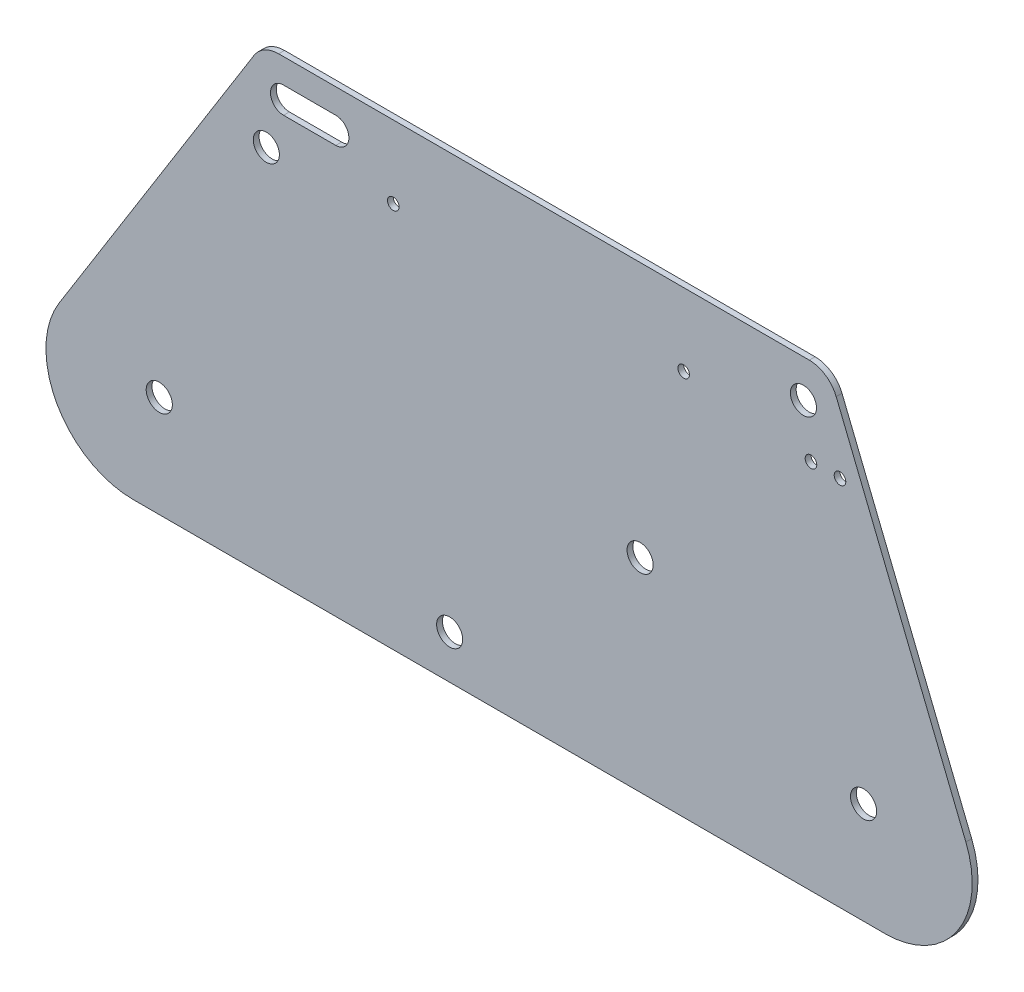
ISO-10303-21;
HEADER;
FILE_DESCRIPTION(('STEP AP214'),'2;1');
FILE_NAME('part.step','',(''),(''),'','','');
FILE_SCHEMA(('AUTOMOTIVE_DESIGN { 1 0 10303 214 1 1 1 1 }'));
ENDSEC;
DATA;
#1=APPLICATION_CONTEXT('core data for automotive mechanical design processes');
#2=APPLICATION_PROTOCOL_DEFINITION('international standard','automotive_design',2000,#1);
#3=PRODUCT_CONTEXT('',#1,'mechanical');
#4=PRODUCT('Part','Part','',(#3));
#5=PRODUCT_RELATED_PRODUCT_CATEGORY('part','',(#4));
#6=PRODUCT_DEFINITION_FORMATION('','',#4);
#7=PRODUCT_DEFINITION_CONTEXT('part definition',#1,'design');
#8=PRODUCT_DEFINITION('design','',#6,#7);
#9=PRODUCT_DEFINITION_SHAPE('','',#8);
#10=(LENGTH_UNIT() NAMED_UNIT(*) SI_UNIT(.MILLI.,.METRE.));
#11=(NAMED_UNIT(*) PLANE_ANGLE_UNIT() SI_UNIT($,.RADIAN.));
#12=(NAMED_UNIT(*) SI_UNIT($,.STERADIAN.) SOLID_ANGLE_UNIT());
#13=UNCERTAINTY_MEASURE_WITH_UNIT(LENGTH_MEASURE(1.E-05),#10,'distance_accuracy_value','');
#14=(GEOMETRIC_REPRESENTATION_CONTEXT(3) GLOBAL_UNCERTAINTY_ASSIGNED_CONTEXT((#13)) GLOBAL_UNIT_ASSIGNED_CONTEXT((#10,
#11,#12)) REPRESENTATION_CONTEXT('',''));
#15=CARTESIAN_POINT('',(0.,0.,0.));
#16=DIRECTION('',(0.,0.,1.));
#17=DIRECTION('',(1.,0.,0.));
#18=AXIS2_PLACEMENT_3D('',#15,#16,#17);
#19=CARTESIAN_POINT('',(0.,0.,2.));
#20=DIRECTION('',(0.,0.,1.));
#21=DIRECTION('',(1.,0.,0.));
#22=AXIS2_PLACEMENT_3D('',#19,#20,#21);
#23=PLANE('',#22);
#24=CARTESIAN_POINT('',(287.565501283629,128.,2.));
#25=DIRECTION('',(0.,0.,1.));
#26=DIRECTION('',(1.,0.,0.));
#27=AXIS2_PLACEMENT_3D('',#24,#25,#26);
#28=CIRCLE('',#27,2.);
#29=CARTESIAN_POINT('',(289.565501283629,128.,2.));
#30=VERTEX_POINT('',#29);
#31=EDGE_CURVE('E558',#30,#30,#28,.T.);
#32=ORIENTED_EDGE('',*,*,#31,.F.);
#33=EDGE_LOOP('',(#32));
#34=FACE_BOUND('',#33,.T.);
#35=CARTESIAN_POINT('',(243.729357601673,133.,2.));
#36=DIRECTION('',(0.,0.,1.));
#37=DIRECTION('',(1.,0.,0.));
#38=AXIS2_PLACEMENT_3D('',#35,#36,#37);
#39=CIRCLE('',#38,2.);
#40=CARTESIAN_POINT('',(245.729357601673,133.,2.));
#41=VERTEX_POINT('',#40);
#42=EDGE_CURVE('E570',#41,#41,#39,.T.);
#43=ORIENTED_EDGE('',*,*,#42,.F.);
#44=EDGE_LOOP('',(#43));
#45=FACE_BOUND('',#44,.T.);
#46=CARTESIAN_POINT('',(228.729357601673,70.,2.));
#47=DIRECTION('',(0.,0.,1.));
#48=DIRECTION('',(1.,0.,0.));
#49=AXIS2_PLACEMENT_3D('',#46,#47,#48);
#50=CIRCLE('',#49,4.50000000000002);
#51=CARTESIAN_POINT('',(233.229357601673,70.,2.));
#52=VERTEX_POINT('',#51);
#53=EDGE_CURVE('E582',#52,#52,#50,.T.);
#54=ORIENTED_EDGE('',*,*,#53,.F.);
#55=EDGE_LOOP('',(#54));
#56=FACE_BOUND('',#55,.T.);
#57=CARTESIAN_POINT('',(63.1416714344996,35.,2.));
#58=DIRECTION('',(0.,0.,1.));
#59=DIRECTION('',(1.,0.,0.));
#60=AXIS2_PLACEMENT_3D('',#57,#58,#59);
#61=CIRCLE('',#60,4.50000000000001);
#62=CARTESIAN_POINT('',(67.6416714344996,35.,2.));
#63=VERTEX_POINT('',#62);
#64=EDGE_CURVE('E594',#63,#63,#61,.T.);
#65=ORIENTED_EDGE('',*,*,#64,.F.);
#66=EDGE_LOOP('',(#65));
#67=FACE_BOUND('',#66,.T.);
#68=CARTESIAN_POINT('',(284.960746882722,145.,2.));
#69=DIRECTION('',(0.,0.,1.));
#70=DIRECTION('',(1.,0.,0.));
#71=AXIS2_PLACEMENT_3D('',#68,#69,#70);
#72=CIRCLE('',#71,4.50000000000002);
#73=CARTESIAN_POINT('',(289.460746882722,145.,2.));
#74=VERTEX_POINT('',#73);
#75=EDGE_CURVE('E170',#74,#74,#72,.T.);
#76=ORIENTED_EDGE('',*,*,#75,.F.);
#77=EDGE_LOOP('',(#76));
#78=FACE_BOUND('',#77,.T.);
#79=DIRECTION('',(-0.374606593415916,0.927183854566786,0.));
#80=VECTOR('',#79,1.);
#81=CARTESIAN_POINT('',(357.565501283629,0.,2.));
#82=LINE('',#81,#80);
#83=CARTESIAN_POINT('',(340.90418786525,41.2381978024775,2.));
#84=VERTEX_POINT('',#83);
#85=CARTESIAN_POINT('',(296.256110978917,151.746065934159,2.));
#86=VERTEX_POINT('',#85);
#87=EDGE_CURVE('E191',#84,#86,#82,.T.);
#88=ORIENTED_EDGE('',*,*,#87,.T.);
#89=CARTESIAN_POINT('',(286.984272433249,148.,2.));
#90=DIRECTION('',(0.,0.,1.));
#91=DIRECTION('',(1.,0.,0.));
#92=AXIS2_PLACEMENT_3D('',#89,#90,#91);
#93=CIRCLE('',#92,10.);
#94=CARTESIAN_POINT('',(286.984272433249,158.,2.));
#95=VERTEX_POINT('',#94);
#96=EDGE_CURVE('E46',#86,#95,#93,.T.);
#97=ORIENTED_EDGE('',*,*,#96,.T.);
#98=DIRECTION('',(-1.,0.,0.));
#99=VECTOR('',#98,1.);
#100=CARTESIAN_POINT('',(98.7293576016731,158.,2.));
#101=LINE('',#100,#99);
#102=CARTESIAN_POINT('',(104.272448116201,158.,2.));
#103=VERTEX_POINT('',#102);
#104=EDGE_CURVE('E195',#95,#103,#101,.T.);
#105=ORIENTED_EDGE('',*,*,#104,.T.);
#106=CARTESIAN_POINT('',(104.272448116201,148.,2.));
#107=DIRECTION('',(0.,0.,1.));
#108=DIRECTION('',(1.,0.,0.));
#109=AXIS2_PLACEMENT_3D('',#106,#107,#108);
#110=CIRCLE('',#109,10.);
#111=CARTESIAN_POINT('',(95.7919671546366,153.299192642332,2.));
#112=VERTEX_POINT('',#111);
#113=EDGE_CURVE('E53',#103,#112,#110,.T.);
#114=ORIENTED_EDGE('',*,*,#113,.T.);
#115=DIRECTION('',(-0.529919264233203,-0.848048096156428,0.));
#116=VECTOR('',#115,1.);
#117=CARTESIAN_POINT('',(0.,0.,2.));
#118=LINE('',#117,#116);
#119=CARTESIAN_POINT('',(28.6799897734497,45.8975779269961,2.));
#120=VERTEX_POINT('',#119);
#121=EDGE_CURVE('E198',#112,#120,#118,.T.);
#122=ORIENTED_EDGE('',*,*,#121,.T.);
#123=CARTESIAN_POINT('',(54.1214326581425,30.,2.));
#124=DIRECTION('',(0.,0.,1.));
#125=DIRECTION('',(1.,0.,0.));
#126=AXIS2_PLACEMENT_3D('',#123,#124,#125);
#127=CIRCLE('',#126,30.);
#128=CARTESIAN_POINT('',(54.1214326581425,0.,2.));
#129=VERTEX_POINT('',#128);
#130=EDGE_CURVE('E231',#120,#129,#127,.T.);
#131=ORIENTED_EDGE('',*,*,#130,.T.);
#132=DIRECTION('',(1.,0.,0.));
#133=VECTOR('',#132,1.);
#134=CARTESIAN_POINT('',(0.,0.,2.));
#135=LINE('',#134,#133);
#136=CARTESIAN_POINT('',(313.088672228246,0.,2.));
#137=VERTEX_POINT('',#136);
#138=EDGE_CURVE('E187',#129,#137,#135,.T.);
#139=ORIENTED_EDGE('',*,*,#138,.T.);
#140=CARTESIAN_POINT('',(313.088672228246,30.,2.));
#141=DIRECTION('',(0.,0.,1.));
#142=DIRECTION('',(1.,0.,0.));
#143=AXIS2_PLACEMENT_3D('',#140,#141,#142);
#144=CIRCLE('',#143,30.);
#145=EDGE_CURVE('E234',#137,#84,#144,.T.);
#146=ORIENTED_EDGE('',*,*,#145,.T.);
#147=EDGE_LOOP('',(#88,#97,#105,#114,#122,#131,#139,#146));
#148=FACE_BOUND('',#147,.T.);
#149=DIRECTION('',(1.,0.,0.));
#150=VECTOR('',#149,1.);
#151=CARTESIAN_POINT('',(105.935375270559,140.5,2.));
#152=LINE('',#151,#150);
#153=CARTESIAN_POINT('',(105.935375270559,140.5,2.));
#154=VERTEX_POINT('',#153);
#155=CARTESIAN_POINT('',(123.935375270559,140.5,2.));
#156=VERTEX_POINT('',#155);
#157=EDGE_CURVE('E142',#154,#156,#152,.T.);
#158=ORIENTED_EDGE('',*,*,#157,.F.);
#159=CARTESIAN_POINT('',(105.935375270559,145.,2.));
#160=DIRECTION('',(0.,0.,1.));
#161=DIRECTION('',(1.,0.,0.));
#162=AXIS2_PLACEMENT_3D('',#159,#160,#161);
#163=CIRCLE('',#162,4.49999999999998);
#164=CARTESIAN_POINT('',(105.935375270559,149.5,2.));
#165=VERTEX_POINT('',#164);
#166=EDGE_CURVE('E131',#165,#154,#163,.T.);
#167=ORIENTED_EDGE('',*,*,#166,.F.);
#168=DIRECTION('',(-1.,0.,0.));
#169=VECTOR('',#168,1.);
#170=CARTESIAN_POINT('',(105.935375270559,149.5,2.));
#171=LINE('',#170,#169);
#172=CARTESIAN_POINT('',(123.935375270559,149.5,2.));
#173=VERTEX_POINT('',#172);
#174=EDGE_CURVE('E161',#173,#165,#171,.T.);
#175=ORIENTED_EDGE('',*,*,#174,.F.);
#176=CARTESIAN_POINT('',(123.935375270559,145.,2.));
#177=DIRECTION('',(0.,0.,1.));
#178=DIRECTION('',(1.,0.,0.));
#179=AXIS2_PLACEMENT_3D('',#176,#177,#178);
#180=CIRCLE('',#179,4.49999999999998);
#181=EDGE_CURVE('E157',#156,#173,#180,.T.);
#182=ORIENTED_EDGE('',*,*,#181,.F.);
#183=EDGE_LOOP('',(#158,#167,#175,#182));
#184=FACE_BOUND('',#183,.T.);
#185=CARTESIAN_POINT('',(305.675867385683,35.,2.));
#186=DIRECTION('',(0.,0.,1.));
#187=DIRECTION('',(1.,0.,0.));
#188=AXIS2_PLACEMENT_3D('',#185,#186,#187);
#189=CIRCLE('',#188,4.50000000000002);
#190=CARTESIAN_POINT('',(310.175867385683,35.,2.));
#191=VERTEX_POINT('',#190);
#192=EDGE_CURVE('E600',#191,#191,#189,.T.);
#193=ORIENTED_EDGE('',*,*,#192,.F.);
#194=EDGE_LOOP('',(#193));
#195=FACE_BOUND('',#194,.T.);
#196=CARTESIAN_POINT('',(163.1416714345,15.,2.));
#197=DIRECTION('',(0.,0.,1.));
#198=DIRECTION('',(1.,0.,0.));
#199=AXIS2_PLACEMENT_3D('',#196,#197,#198);
#200=CIRCLE('',#199,4.49999999999999);
#201=CARTESIAN_POINT('',(167.6416714345,15.,2.));
#202=VERTEX_POINT('',#201);
#203=EDGE_CURVE('E588',#202,#202,#200,.T.);
#204=ORIENTED_EDGE('',*,*,#203,.F.);
#205=EDGE_LOOP('',(#204));
#206=FACE_BOUND('',#205,.T.);
#207=CARTESIAN_POINT('',(100.,128.,2.));
#208=DIRECTION('',(0.,0.,1.));
#209=DIRECTION('',(1.,0.,0.));
#210=AXIS2_PLACEMENT_3D('',#207,#208,#209);
#211=CIRCLE('',#210,4.49999999999999);
#212=CARTESIAN_POINT('',(104.5,128.,2.));
#213=VERTEX_POINT('',#212);
#214=EDGE_CURVE('E576',#213,#213,#211,.T.);
#215=ORIENTED_EDGE('',*,*,#214,.F.);
#216=EDGE_LOOP('',(#215));
#217=FACE_BOUND('',#216,.T.);
#218=CARTESIAN_POINT('',(143.729357601673,133.,2.));
#219=DIRECTION('',(0.,0.,1.));
#220=DIRECTION('',(1.,0.,0.));
#221=AXIS2_PLACEMENT_3D('',#218,#219,#220);
#222=CIRCLE('',#221,2.);
#223=CARTESIAN_POINT('',(145.729357601673,133.,2.));
#224=VERTEX_POINT('',#223);
#225=EDGE_CURVE('E564',#224,#224,#222,.T.);
#226=ORIENTED_EDGE('',*,*,#225,.F.);
#227=EDGE_LOOP('',(#226));
#228=FACE_BOUND('',#227,.T.);
#229=CARTESIAN_POINT('',(297.565501283629,128.,2.));
#230=DIRECTION('',(0.,0.,1.));
#231=DIRECTION('',(1.,0.,0.));
#232=AXIS2_PLACEMENT_3D('',#229,#230,#231);
#233=CIRCLE('',#232,2.);
#234=CARTESIAN_POINT('',(299.565501283629,128.,2.));
#235=VERTEX_POINT('',#234);
#236=EDGE_CURVE('E552',#235,#235,#233,.T.);
#237=ORIENTED_EDGE('',*,*,#236,.F.);
#238=EDGE_LOOP('',(#237));
#239=FACE_BOUND('',#238,.T.);
#240=ADVANCED_FACE('F37',(#34,#45,#56,#67,#78,#148,#184,#195,#206,#217,#228,#239),#23,.T.);
#241=CARTESIAN_POINT('',(0.,0.,0.));
#242=DIRECTION('',(0.,0.,1.));
#243=DIRECTION('',(1.,0.,0.));
#244=AXIS2_PLACEMENT_3D('',#241,#242,#243);
#245=PLANE('',#244);
#246=DIRECTION('',(-1.,0.,0.));
#247=VECTOR('',#246,1.);
#248=CARTESIAN_POINT('',(98.7293576016731,158.,0.));
#249=LINE('',#248,#247);
#250=CARTESIAN_POINT('',(286.984272433249,158.,0.));
#251=VERTEX_POINT('',#250);
#252=CARTESIAN_POINT('',(104.272448116201,158.,0.));
#253=VERTEX_POINT('',#252);
#254=EDGE_CURVE('E208',#251,#253,#249,.T.);
#255=ORIENTED_EDGE('',*,*,#254,.F.);
#256=CARTESIAN_POINT('',(286.984272433249,148.,0.));
#257=DIRECTION('',(0.,0.,1.));
#258=DIRECTION('',(1.,0.,0.));
#259=AXIS2_PLACEMENT_3D('',#256,#257,#258);
#260=CIRCLE('',#259,10.);
#261=CARTESIAN_POINT('',(296.256110978917,151.746065934159,0.));
#262=VERTEX_POINT('',#261);
#263=EDGE_CURVE('E251',#251,#262,#260,.F.);
#264=ORIENTED_EDGE('',*,*,#263,.T.);
#265=DIRECTION('',(-0.374606593415916,0.927183854566786,0.));
#266=VECTOR('',#265,1.);
#267=CARTESIAN_POINT('',(357.565501283629,0.,0.));
#268=LINE('',#267,#266);
#269=CARTESIAN_POINT('',(340.90418786525,41.2381978024775,0.));
#270=VERTEX_POINT('',#269);
#271=EDGE_CURVE('E205',#270,#262,#268,.T.);
#272=ORIENTED_EDGE('',*,*,#271,.F.);
#273=CARTESIAN_POINT('',(313.088672228246,30.,0.));
#274=DIRECTION('',(0.,0.,1.));
#275=DIRECTION('',(1.,0.,0.));
#276=AXIS2_PLACEMENT_3D('',#273,#274,#275);
#277=CIRCLE('',#276,30.);
#278=CARTESIAN_POINT('',(313.088672228246,0.,0.));
#279=VERTEX_POINT('',#278);
#280=EDGE_CURVE('E221',#270,#279,#277,.F.);
#281=ORIENTED_EDGE('',*,*,#280,.T.);
#282=DIRECTION('',(1.,0.,0.));
#283=VECTOR('',#282,1.);
#284=CARTESIAN_POINT('',(0.,0.,0.));
#285=LINE('',#284,#283);
#286=CARTESIAN_POINT('',(54.1214326581425,0.,0.));
#287=VERTEX_POINT('',#286);
#288=EDGE_CURVE('E151',#287,#279,#285,.T.);
#289=ORIENTED_EDGE('',*,*,#288,.F.);
#290=CARTESIAN_POINT('',(54.1214326581425,30.,0.));
#291=DIRECTION('',(0.,0.,1.));
#292=DIRECTION('',(1.,0.,0.));
#293=AXIS2_PLACEMENT_3D('',#290,#291,#292);
#294=CIRCLE('',#293,30.);
#295=CARTESIAN_POINT('',(28.6799897734497,45.8975779269961,0.));
#296=VERTEX_POINT('',#295);
#297=EDGE_CURVE('E217',#287,#296,#294,.F.);
#298=ORIENTED_EDGE('',*,*,#297,.T.);
#299=DIRECTION('',(-0.529919264233203,-0.848048096156428,0.));
#300=VECTOR('',#299,1.);
#301=CARTESIAN_POINT('',(0.,0.,0.));
#302=LINE('',#301,#300);
#303=CARTESIAN_POINT('',(95.7919671546366,153.299192642332,0.));
#304=VERTEX_POINT('',#303);
#305=EDGE_CURVE('E192',#304,#296,#302,.T.);
#306=ORIENTED_EDGE('',*,*,#305,.F.);
#307=CARTESIAN_POINT('',(104.272448116201,148.,0.));
#308=DIRECTION('',(0.,0.,1.));
#309=DIRECTION('',(1.,0.,0.));
#310=AXIS2_PLACEMENT_3D('',#307,#308,#309);
#311=CIRCLE('',#310,10.);
#312=EDGE_CURVE('E248',#304,#253,#311,.F.);
#313=ORIENTED_EDGE('',*,*,#312,.T.);
#314=EDGE_LOOP('',(#255,#264,#272,#281,#289,#298,#306,#313));
#315=FACE_BOUND('',#314,.T.);
#316=CARTESIAN_POINT('',(105.935375270559,145.,0.));
#317=DIRECTION('',(0.,0.,1.));
#318=DIRECTION('',(1.,0.,0.));
#319=AXIS2_PLACEMENT_3D('',#316,#317,#318);
#320=CIRCLE('',#319,4.49999999999998);
#321=CARTESIAN_POINT('',(105.935375270559,149.5,0.));
#322=VERTEX_POINT('',#321);
#323=CARTESIAN_POINT('',(105.935375270559,140.5,0.));
#324=VERTEX_POINT('',#323);
#325=EDGE_CURVE('E167',#322,#324,#320,.T.);
#326=ORIENTED_EDGE('',*,*,#325,.T.);
#327=DIRECTION('',(1.,0.,0.));
#328=VECTOR('',#327,1.);
#329=CARTESIAN_POINT('',(105.935375270559,140.5,0.));
#330=LINE('',#329,#328);
#331=CARTESIAN_POINT('',(123.935375270559,140.5,0.));
#332=VERTEX_POINT('',#331);
#333=EDGE_CURVE('E149',#324,#332,#330,.T.);
#334=ORIENTED_EDGE('',*,*,#333,.T.);
#335=CARTESIAN_POINT('',(123.935375270559,145.,0.));
#336=DIRECTION('',(0.,0.,1.));
#337=DIRECTION('',(1.,0.,0.));
#338=AXIS2_PLACEMENT_3D('',#335,#336,#337);
#339=CIRCLE('',#338,4.49999999999998);
#340=CARTESIAN_POINT('',(123.935375270559,149.5,0.));
#341=VERTEX_POINT('',#340);
#342=EDGE_CURVE('E173',#332,#341,#339,.T.);
#343=ORIENTED_EDGE('',*,*,#342,.T.);
#344=DIRECTION('',(-1.,0.,0.));
#345=VECTOR('',#344,1.);
#346=CARTESIAN_POINT('',(105.935375270559,149.5,0.));
#347=LINE('',#346,#345);
#348=EDGE_CURVE('E143',#341,#322,#347,.T.);
#349=ORIENTED_EDGE('',*,*,#348,.T.);
#350=EDGE_LOOP('',(#326,#334,#343,#349));
#351=FACE_BOUND('',#350,.T.);
#352=CARTESIAN_POINT('',(284.960746882722,145.,0.));
#353=DIRECTION('',(0.,0.,1.));
#354=DIRECTION('',(1.,0.,0.));
#355=AXIS2_PLACEMENT_3D('',#352,#353,#354);
#356=CIRCLE('',#355,4.50000000000002);
#357=CARTESIAN_POINT('',(289.460746882722,145.,0.));
#358=VERTEX_POINT('',#357);
#359=EDGE_CURVE('E514',#358,#358,#356,.T.);
#360=ORIENTED_EDGE('',*,*,#359,.T.);
#361=EDGE_LOOP('',(#360));
#362=FACE_BOUND('',#361,.T.);
#363=CARTESIAN_POINT('',(305.675867385683,35.,0.));
#364=DIRECTION('',(0.,0.,1.));
#365=DIRECTION('',(1.,0.,0.));
#366=AXIS2_PLACEMENT_3D('',#363,#364,#365);
#367=CIRCLE('',#366,4.50000000000002);
#368=CARTESIAN_POINT('',(310.175867385683,35.,0.));
#369=VERTEX_POINT('',#368);
#370=EDGE_CURVE('E518',#369,#369,#367,.T.);
#371=ORIENTED_EDGE('',*,*,#370,.T.);
#372=EDGE_LOOP('',(#371));
#373=FACE_BOUND('',#372,.T.);
#374=CARTESIAN_POINT('',(63.1416714344996,35.,0.));
#375=DIRECTION('',(0.,0.,1.));
#376=DIRECTION('',(1.,0.,0.));
#377=AXIS2_PLACEMENT_3D('',#374,#375,#376);
#378=CIRCLE('',#377,4.50000000000001);
#379=CARTESIAN_POINT('',(67.6416714344996,35.,0.));
#380=VERTEX_POINT('',#379);
#381=EDGE_CURVE('E522',#380,#380,#378,.T.);
#382=ORIENTED_EDGE('',*,*,#381,.T.);
#383=EDGE_LOOP('',(#382));
#384=FACE_BOUND('',#383,.T.);
#385=CARTESIAN_POINT('',(163.1416714345,15.,0.));
#386=DIRECTION('',(0.,0.,1.));
#387=DIRECTION('',(1.,0.,0.));
#388=AXIS2_PLACEMENT_3D('',#385,#386,#387);
#389=CIRCLE('',#388,4.49999999999999);
#390=CARTESIAN_POINT('',(167.6416714345,15.,0.));
#391=VERTEX_POINT('',#390);
#392=EDGE_CURVE('E526',#391,#391,#389,.T.);
#393=ORIENTED_EDGE('',*,*,#392,.T.);
#394=EDGE_LOOP('',(#393));
#395=FACE_BOUND('',#394,.T.);
#396=CARTESIAN_POINT('',(228.729357601673,70.,0.));
#397=DIRECTION('',(0.,0.,1.));
#398=DIRECTION('',(1.,0.,0.));
#399=AXIS2_PLACEMENT_3D('',#396,#397,#398);
#400=CIRCLE('',#399,4.50000000000002);
#401=CARTESIAN_POINT('',(233.229357601673,70.,0.));
#402=VERTEX_POINT('',#401);
#403=EDGE_CURVE('E530',#402,#402,#400,.T.);
#404=ORIENTED_EDGE('',*,*,#403,.T.);
#405=EDGE_LOOP('',(#404));
#406=FACE_BOUND('',#405,.T.);
#407=CARTESIAN_POINT('',(100.,128.,0.));
#408=DIRECTION('',(0.,0.,1.));
#409=DIRECTION('',(1.,0.,0.));
#410=AXIS2_PLACEMENT_3D('',#407,#408,#409);
#411=CIRCLE('',#410,4.49999999999999);
#412=CARTESIAN_POINT('',(104.5,128.,0.));
#413=VERTEX_POINT('',#412);
#414=EDGE_CURVE('E534',#413,#413,#411,.T.);
#415=ORIENTED_EDGE('',*,*,#414,.T.);
#416=EDGE_LOOP('',(#415));
#417=FACE_BOUND('',#416,.T.);
#418=CARTESIAN_POINT('',(243.729357601673,133.,0.));
#419=DIRECTION('',(0.,0.,1.));
#420=DIRECTION('',(1.,0.,0.));
#421=AXIS2_PLACEMENT_3D('',#418,#419,#420);
#422=CIRCLE('',#421,2.);
#423=CARTESIAN_POINT('',(245.729357601673,133.,0.));
#424=VERTEX_POINT('',#423);
#425=EDGE_CURVE('E538',#424,#424,#422,.T.);
#426=ORIENTED_EDGE('',*,*,#425,.T.);
#427=EDGE_LOOP('',(#426));
#428=FACE_BOUND('',#427,.T.);
#429=CARTESIAN_POINT('',(143.729357601673,133.,0.));
#430=DIRECTION('',(0.,0.,1.));
#431=DIRECTION('',(1.,0.,0.));
#432=AXIS2_PLACEMENT_3D('',#429,#430,#431);
#433=CIRCLE('',#432,2.);
#434=CARTESIAN_POINT('',(145.729357601673,133.,0.));
#435=VERTEX_POINT('',#434);
#436=EDGE_CURVE('E542',#435,#435,#433,.T.);
#437=ORIENTED_EDGE('',*,*,#436,.T.);
#438=EDGE_LOOP('',(#437));
#439=FACE_BOUND('',#438,.T.);
#440=CARTESIAN_POINT('',(287.565501283629,128.,0.));
#441=DIRECTION('',(0.,0.,1.));
#442=DIRECTION('',(1.,0.,0.));
#443=AXIS2_PLACEMENT_3D('',#440,#441,#442);
#444=CIRCLE('',#443,2.);
#445=CARTESIAN_POINT('',(289.565501283629,128.,0.));
#446=VERTEX_POINT('',#445);
#447=EDGE_CURVE('E546',#446,#446,#444,.T.);
#448=ORIENTED_EDGE('',*,*,#447,.T.);
#449=EDGE_LOOP('',(#448));
#450=FACE_BOUND('',#449,.T.);
#451=CARTESIAN_POINT('',(297.565501283629,128.,0.));
#452=DIRECTION('',(0.,0.,1.));
#453=DIRECTION('',(1.,0.,0.));
#454=AXIS2_PLACEMENT_3D('',#451,#452,#453);
#455=CIRCLE('',#454,2.);
#456=CARTESIAN_POINT('',(299.565501283629,128.,0.));
#457=VERTEX_POINT('',#456);
#458=EDGE_CURVE('E549',#457,#457,#455,.T.);
#459=ORIENTED_EDGE('',*,*,#458,.T.);
#460=EDGE_LOOP('',(#459));
#461=FACE_BOUND('',#460,.T.);
#462=ADVANCED_FACE('F269',(#315,#351,#362,#373,#384,#395,#406,#417,#428,#439,#450,#461),#245,.F.);
#463=CARTESIAN_POINT('',(0.,0.,2.));
#464=DIRECTION('',(0.,1.,0.));
#465=DIRECTION('',(0.,0.,1.));
#466=AXIS2_PLACEMENT_3D('',#463,#464,#465);
#467=PLANE('',#466);
#468=ORIENTED_EDGE('',*,*,#288,.T.);
#469=DIRECTION('',(0.,0.,-1.));
#470=VECTOR('',#469,1.);
#471=CARTESIAN_POINT('',(313.088672228246,0.,2.));
#472=LINE('',#471,#470);
#473=EDGE_CURVE('E228',#279,#137,#472,.F.);
#474=ORIENTED_EDGE('',*,*,#473,.T.);
#475=ORIENTED_EDGE('',*,*,#138,.F.);
#476=DIRECTION('',(0.,0.,-1.));
#477=VECTOR('',#476,1.);
#478=CARTESIAN_POINT('',(54.1214326581425,0.,2.));
#479=LINE('',#478,#477);
#480=EDGE_CURVE('E224',#129,#287,#479,.T.);
#481=ORIENTED_EDGE('',*,*,#480,.T.);
#482=EDGE_LOOP('',(#468,#474,#475,#481));
#483=FACE_BOUND('',#482,.T.);
#484=ADVANCED_FACE('F279',(#483),#467,.F.);
#485=CARTESIAN_POINT('',(357.565501283629,0.,2.));
#486=DIRECTION('',(-0.927183854566786,-0.374606593415916,0.));
#487=DIRECTION('',(0.374606593415916,-0.927183854566786,0.));
#488=AXIS2_PLACEMENT_3D('',#485,#486,#487);
#489=PLANE('',#488);
#490=ORIENTED_EDGE('',*,*,#271,.T.);
#491=DIRECTION('',(0.,0.,-1.));
#492=VECTOR('',#491,1.);
#493=CARTESIAN_POINT('',(296.256110978917,151.746065934159,2.));
#494=LINE('',#493,#492);
#495=EDGE_CURVE('E61',#262,#86,#494,.F.);
#496=ORIENTED_EDGE('',*,*,#495,.T.);
#497=ORIENTED_EDGE('',*,*,#87,.F.);
#498=DIRECTION('',(0.,0.,-1.));
#499=VECTOR('',#498,1.);
#500=CARTESIAN_POINT('',(340.90418786525,41.2381978024775,2.));
#501=LINE('',#500,#499);
#502=EDGE_CURVE('E201',#84,#270,#501,.T.);
#503=ORIENTED_EDGE('',*,*,#502,.T.);
#504=EDGE_LOOP('',(#490,#496,#497,#503));
#505=FACE_BOUND('',#504,.T.);
#506=ADVANCED_FACE('F271',(#505),#489,.F.);
#507=CARTESIAN_POINT('',(98.7293576016731,158.,2.));
#508=DIRECTION('',(0.,-1.,0.));
#509=DIRECTION('',(0.,0.,-1.));
#510=AXIS2_PLACEMENT_3D('',#507,#508,#509);
#511=PLANE('',#510);
#512=ORIENTED_EDGE('',*,*,#104,.F.);
#513=DIRECTION('',(0.,0.,-1.));
#514=VECTOR('',#513,1.);
#515=CARTESIAN_POINT('',(286.984272433249,158.,2.));
#516=LINE('',#515,#514);
#517=EDGE_CURVE('E244',#95,#251,#516,.T.);
#518=ORIENTED_EDGE('',*,*,#517,.T.);
#519=ORIENTED_EDGE('',*,*,#254,.T.);
#520=DIRECTION('',(0.,0.,-1.));
#521=VECTOR('',#520,1.);
#522=CARTESIAN_POINT('',(104.272448116201,158.,2.));
#523=LINE('',#522,#521);
#524=EDGE_CURVE('E241',#253,#103,#523,.F.);
#525=ORIENTED_EDGE('',*,*,#524,.T.);
#526=EDGE_LOOP('',(#512,#518,#519,#525));
#527=FACE_BOUND('',#526,.T.);
#528=ADVANCED_FACE('F263',(#527),#511,.F.);
#529=CARTESIAN_POINT('',(0.,0.,2.));
#530=DIRECTION('',(0.848048096156428,-0.529919264233203,0.));
#531=DIRECTION('',(0.529919264233203,0.848048096156428,0.));
#532=AXIS2_PLACEMENT_3D('',#529,#530,#531);
#533=PLANE('',#532);
#534=ORIENTED_EDGE('',*,*,#121,.F.);
#535=DIRECTION('',(0.,0.,-1.));
#536=VECTOR('',#535,1.);
#537=CARTESIAN_POINT('',(95.7919671546366,153.299192642332,2.));
#538=LINE('',#537,#536);
#539=EDGE_CURVE('E11',#112,#304,#538,.T.);
#540=ORIENTED_EDGE('',*,*,#539,.T.);
#541=ORIENTED_EDGE('',*,*,#305,.T.);
#542=DIRECTION('',(0.,0.,-1.));
#543=VECTOR('',#542,1.);
#544=CARTESIAN_POINT('',(28.6799897734497,45.8975779269961,2.));
#545=LINE('',#544,#543);
#546=EDGE_CURVE('E237',#296,#120,#545,.F.);
#547=ORIENTED_EDGE('',*,*,#546,.T.);
#548=EDGE_LOOP('',(#534,#540,#541,#547));
#549=FACE_BOUND('',#548,.T.);
#550=ADVANCED_FACE('F288',(#549),#533,.F.);
#551=CARTESIAN_POINT('',(105.935375270559,145.,2.));
#552=DIRECTION('',(0.,0.,-1.));
#553=DIRECTION('',(-1.,0.,0.));
#554=AXIS2_PLACEMENT_3D('',#551,#552,#553);
#555=CYLINDRICAL_SURFACE('',#554,4.49999999999998);
#556=ORIENTED_EDGE('',*,*,#325,.F.);
#557=DIRECTION('',(0.,0.,-1.));
#558=VECTOR('',#557,1.);
#559=CARTESIAN_POINT('',(105.935375270559,149.5,2.));
#560=LINE('',#559,#558);
#561=EDGE_CURVE('E137',#165,#322,#560,.T.);
#562=ORIENTED_EDGE('',*,*,#561,.F.);
#563=ORIENTED_EDGE('',*,*,#166,.T.);
#564=DIRECTION('',(0.,0.,-1.));
#565=VECTOR('',#564,1.);
#566=CARTESIAN_POINT('',(105.935375270559,140.5,2.));
#567=LINE('',#566,#565);
#568=EDGE_CURVE('E134',#154,#324,#567,.T.);
#569=ORIENTED_EDGE('',*,*,#568,.T.);
#570=EDGE_LOOP('',(#556,#562,#563,#569));
#571=FACE_BOUND('',#570,.T.);
#572=ADVANCED_FACE('F133',(#571),#555,.F.);
#573=CARTESIAN_POINT('',(105.935375270559,140.5,2.));
#574=DIRECTION('',(0.,1.,0.));
#575=DIRECTION('',(0.,0.,1.));
#576=AXIS2_PLACEMENT_3D('',#573,#574,#575);
#577=PLANE('',#576);
#578=ORIENTED_EDGE('',*,*,#333,.F.);
#579=ORIENTED_EDGE('',*,*,#568,.F.);
#580=ORIENTED_EDGE('',*,*,#157,.T.);
#581=DIRECTION('',(0.,0.,-1.));
#582=VECTOR('',#581,1.);
#583=CARTESIAN_POINT('',(123.935375270559,140.5,2.));
#584=LINE('',#583,#582);
#585=EDGE_CURVE('E152',#156,#332,#584,.T.);
#586=ORIENTED_EDGE('',*,*,#585,.T.);
#587=EDGE_LOOP('',(#578,#579,#580,#586));
#588=FACE_BOUND('',#587,.T.);
#589=ADVANCED_FACE('F146',(#588),#577,.T.);
#590=CARTESIAN_POINT('',(123.935375270559,145.,2.));
#591=DIRECTION('',(0.,0.,-1.));
#592=DIRECTION('',(-1.,0.,0.));
#593=AXIS2_PLACEMENT_3D('',#590,#591,#592);
#594=CYLINDRICAL_SURFACE('',#593,4.49999999999998);
#595=ORIENTED_EDGE('',*,*,#342,.F.);
#596=ORIENTED_EDGE('',*,*,#585,.F.);
#597=ORIENTED_EDGE('',*,*,#181,.T.);
#598=DIRECTION('',(0.,0.,-1.));
#599=VECTOR('',#598,1.);
#600=CARTESIAN_POINT('',(123.935375270559,149.5,2.));
#601=LINE('',#600,#599);
#602=EDGE_CURVE('E182',#173,#341,#601,.T.);
#603=ORIENTED_EDGE('',*,*,#602,.T.);
#604=EDGE_LOOP('',(#595,#596,#597,#603));
#605=FACE_BOUND('',#604,.T.);
#606=ADVANCED_FACE('F473',(#605),#594,.F.);
#607=CARTESIAN_POINT('',(105.935375270559,149.5,2.));
#608=DIRECTION('',(0.,-1.,0.));
#609=DIRECTION('',(0.,0.,-1.));
#610=AXIS2_PLACEMENT_3D('',#607,#608,#609);
#611=PLANE('',#610);
#612=ORIENTED_EDGE('',*,*,#348,.F.);
#613=ORIENTED_EDGE('',*,*,#602,.F.);
#614=ORIENTED_EDGE('',*,*,#174,.T.);
#615=ORIENTED_EDGE('',*,*,#561,.T.);
#616=EDGE_LOOP('',(#612,#613,#614,#615));
#617=FACE_BOUND('',#616,.T.);
#618=ADVANCED_FACE('F464',(#617),#611,.T.);
#619=CARTESIAN_POINT('',(284.960746882722,145.,2.));
#620=DIRECTION('',(0.,0.,-1.));
#621=DIRECTION('',(-1.,0.,0.));
#622=AXIS2_PLACEMENT_3D('',#619,#620,#621);
#623=CYLINDRICAL_SURFACE('',#622,4.50000000000002);
#624=ORIENTED_EDGE('',*,*,#75,.T.);
#625=EDGE_LOOP('',(#624));
#626=FACE_BOUND('',#625,.T.);
#627=ORIENTED_EDGE('',*,*,#359,.F.);
#628=EDGE_LOOP('',(#627));
#629=FACE_BOUND('',#628,.T.);
#630=ADVANCED_FACE('F455',(#626,#629),#623,.F.);
#631=CARTESIAN_POINT('',(305.675867385683,35.,2.));
#632=DIRECTION('',(0.,0.,-1.));
#633=DIRECTION('',(-1.,0.,0.));
#634=AXIS2_PLACEMENT_3D('',#631,#632,#633);
#635=CYLINDRICAL_SURFACE('',#634,4.50000000000002);
#636=ORIENTED_EDGE('',*,*,#192,.T.);
#637=EDGE_LOOP('',(#636));
#638=FACE_BOUND('',#637,.T.);
#639=ORIENTED_EDGE('',*,*,#370,.F.);
#640=EDGE_LOOP('',(#639));
#641=FACE_BOUND('',#640,.T.);
#642=ADVANCED_FACE('F446',(#638,#641),#635,.F.);
#643=CARTESIAN_POINT('',(63.1416714344996,35.,2.));
#644=DIRECTION('',(0.,0.,-1.));
#645=DIRECTION('',(-1.,0.,0.));
#646=AXIS2_PLACEMENT_3D('',#643,#644,#645);
#647=CYLINDRICAL_SURFACE('',#646,4.50000000000001);
#648=ORIENTED_EDGE('',*,*,#64,.T.);
#649=EDGE_LOOP('',(#648));
#650=FACE_BOUND('',#649,.T.);
#651=ORIENTED_EDGE('',*,*,#381,.F.);
#652=EDGE_LOOP('',(#651));
#653=FACE_BOUND('',#652,.T.);
#654=ADVANCED_FACE('F437',(#650,#653),#647,.F.);
#655=CARTESIAN_POINT('',(163.1416714345,15.,2.));
#656=DIRECTION('',(0.,0.,-1.));
#657=DIRECTION('',(-1.,0.,0.));
#658=AXIS2_PLACEMENT_3D('',#655,#656,#657);
#659=CYLINDRICAL_SURFACE('',#658,4.49999999999999);
#660=ORIENTED_EDGE('',*,*,#203,.T.);
#661=EDGE_LOOP('',(#660));
#662=FACE_BOUND('',#661,.T.);
#663=ORIENTED_EDGE('',*,*,#392,.F.);
#664=EDGE_LOOP('',(#663));
#665=FACE_BOUND('',#664,.T.);
#666=ADVANCED_FACE('F428',(#662,#665),#659,.F.);
#667=CARTESIAN_POINT('',(228.729357601673,70.,2.));
#668=DIRECTION('',(0.,0.,-1.));
#669=DIRECTION('',(-1.,0.,0.));
#670=AXIS2_PLACEMENT_3D('',#667,#668,#669);
#671=CYLINDRICAL_SURFACE('',#670,4.50000000000002);
#672=ORIENTED_EDGE('',*,*,#53,.T.);
#673=EDGE_LOOP('',(#672));
#674=FACE_BOUND('',#673,.T.);
#675=ORIENTED_EDGE('',*,*,#403,.F.);
#676=EDGE_LOOP('',(#675));
#677=FACE_BOUND('',#676,.T.);
#678=ADVANCED_FACE('F419',(#674,#677),#671,.F.);
#679=CARTESIAN_POINT('',(100.,128.,2.));
#680=DIRECTION('',(0.,0.,-1.));
#681=DIRECTION('',(-1.,0.,0.));
#682=AXIS2_PLACEMENT_3D('',#679,#680,#681);
#683=CYLINDRICAL_SURFACE('',#682,4.49999999999999);
#684=ORIENTED_EDGE('',*,*,#214,.T.);
#685=EDGE_LOOP('',(#684));
#686=FACE_BOUND('',#685,.T.);
#687=ORIENTED_EDGE('',*,*,#414,.F.);
#688=EDGE_LOOP('',(#687));
#689=FACE_BOUND('',#688,.T.);
#690=ADVANCED_FACE('F410',(#686,#689),#683,.F.);
#691=CARTESIAN_POINT('',(243.729357601673,133.,2.));
#692=DIRECTION('',(0.,0.,-1.));
#693=DIRECTION('',(-1.,0.,0.));
#694=AXIS2_PLACEMENT_3D('',#691,#692,#693);
#695=CYLINDRICAL_SURFACE('',#694,2.);
#696=ORIENTED_EDGE('',*,*,#42,.T.);
#697=EDGE_LOOP('',(#696));
#698=FACE_BOUND('',#697,.T.);
#699=ORIENTED_EDGE('',*,*,#425,.F.);
#700=EDGE_LOOP('',(#699));
#701=FACE_BOUND('',#700,.T.);
#702=ADVANCED_FACE('F401',(#698,#701),#695,.F.);
#703=CARTESIAN_POINT('',(143.729357601673,133.,2.));
#704=DIRECTION('',(0.,0.,-1.));
#705=DIRECTION('',(-1.,0.,0.));
#706=AXIS2_PLACEMENT_3D('',#703,#704,#705);
#707=CYLINDRICAL_SURFACE('',#706,2.);
#708=ORIENTED_EDGE('',*,*,#225,.T.);
#709=EDGE_LOOP('',(#708));
#710=FACE_BOUND('',#709,.T.);
#711=ORIENTED_EDGE('',*,*,#436,.F.);
#712=EDGE_LOOP('',(#711));
#713=FACE_BOUND('',#712,.T.);
#714=ADVANCED_FACE('F392',(#710,#713),#707,.F.);
#715=CARTESIAN_POINT('',(287.565501283629,128.,2.));
#716=DIRECTION('',(0.,0.,-1.));
#717=DIRECTION('',(-1.,0.,0.));
#718=AXIS2_PLACEMENT_3D('',#715,#716,#717);
#719=CYLINDRICAL_SURFACE('',#718,2.);
#720=ORIENTED_EDGE('',*,*,#31,.T.);
#721=EDGE_LOOP('',(#720));
#722=FACE_BOUND('',#721,.T.);
#723=ORIENTED_EDGE('',*,*,#447,.F.);
#724=EDGE_LOOP('',(#723));
#725=FACE_BOUND('',#724,.T.);
#726=ADVANCED_FACE('F385',(#722,#725),#719,.F.);
#727=CARTESIAN_POINT('',(297.565501283629,128.,2.));
#728=DIRECTION('',(0.,0.,-1.));
#729=DIRECTION('',(-1.,0.,0.));
#730=AXIS2_PLACEMENT_3D('',#727,#728,#729);
#731=CYLINDRICAL_SURFACE('',#730,2.);
#732=ORIENTED_EDGE('',*,*,#236,.T.);
#733=EDGE_LOOP('',(#732));
#734=FACE_BOUND('',#733,.T.);
#735=ORIENTED_EDGE('',*,*,#458,.F.);
#736=EDGE_LOOP('',(#735));
#737=FACE_BOUND('',#736,.T.);
#738=ADVANCED_FACE('F317',(#734,#737),#731,.F.);
#739=CARTESIAN_POINT('',(313.088672228246,30.,2.));
#740=DIRECTION('',(0.,0.,-1.));
#741=DIRECTION('',(-1.,0.,0.));
#742=AXIS2_PLACEMENT_3D('',#739,#740,#741);
#743=CYLINDRICAL_SURFACE('',#742,30.);
#744=ORIENTED_EDGE('',*,*,#145,.F.);
#745=ORIENTED_EDGE('',*,*,#473,.F.);
#746=ORIENTED_EDGE('',*,*,#280,.F.);
#747=ORIENTED_EDGE('',*,*,#502,.F.);
#748=EDGE_LOOP('',(#744,#745,#746,#747));
#749=FACE_BOUND('',#748,.T.);
#750=ADVANCED_FACE('F275',(#749),#743,.T.);
#751=CARTESIAN_POINT('',(54.1214326581425,30.,2.));
#752=DIRECTION('',(0.,0.,-1.));
#753=DIRECTION('',(-1.,0.,0.));
#754=AXIS2_PLACEMENT_3D('',#751,#752,#753);
#755=CYLINDRICAL_SURFACE('',#754,30.);
#756=ORIENTED_EDGE('',*,*,#130,.F.);
#757=ORIENTED_EDGE('',*,*,#546,.F.);
#758=ORIENTED_EDGE('',*,*,#297,.F.);
#759=ORIENTED_EDGE('',*,*,#480,.F.);
#760=EDGE_LOOP('',(#756,#757,#758,#759));
#761=FACE_BOUND('',#760,.T.);
#762=ADVANCED_FACE('F284',(#761),#755,.T.);
#763=CARTESIAN_POINT('',(286.984272433249,148.,2.));
#764=DIRECTION('',(0.,0.,-1.));
#765=DIRECTION('',(-1.,0.,0.));
#766=AXIS2_PLACEMENT_3D('',#763,#764,#765);
#767=CYLINDRICAL_SURFACE('',#766,10.);
#768=ORIENTED_EDGE('',*,*,#96,.F.);
#769=ORIENTED_EDGE('',*,*,#495,.F.);
#770=ORIENTED_EDGE('',*,*,#263,.F.);
#771=ORIENTED_EDGE('',*,*,#517,.F.);
#772=EDGE_LOOP('',(#768,#769,#770,#771));
#773=FACE_BOUND('',#772,.T.);
#774=ADVANCED_FACE('F266',(#773),#767,.T.);
#775=CARTESIAN_POINT('',(104.272448116201,148.,2.));
#776=DIRECTION('',(0.,0.,-1.));
#777=DIRECTION('',(-1.,0.,0.));
#778=AXIS2_PLACEMENT_3D('',#775,#776,#777);
#779=CYLINDRICAL_SURFACE('',#778,10.);
#780=ORIENTED_EDGE('',*,*,#113,.F.);
#781=ORIENTED_EDGE('',*,*,#524,.F.);
#782=ORIENTED_EDGE('',*,*,#312,.F.);
#783=ORIENTED_EDGE('',*,*,#539,.F.);
#784=EDGE_LOOP('',(#780,#781,#782,#783));
#785=FACE_BOUND('',#784,.T.);
#786=ADVANCED_FACE('F39',(#785),#779,.T.);
#787=CLOSED_SHELL('',(#240,#462,#484,#506,#528,#550,#572,#589,#606,#618,#630,#642,#654,#666,
#678,#690,#702,#714,#726,#738,#750,#762,#774,#786));
#788=MANIFOLD_SOLID_BREP('B2',#787);
#789=ADVANCED_BREP_SHAPE_REPRESENTATION('',(#18,#788),#14);
#790=SHAPE_DEFINITION_REPRESENTATION(#9,#789);
ENDSEC;
END-ISO-10303-21;
